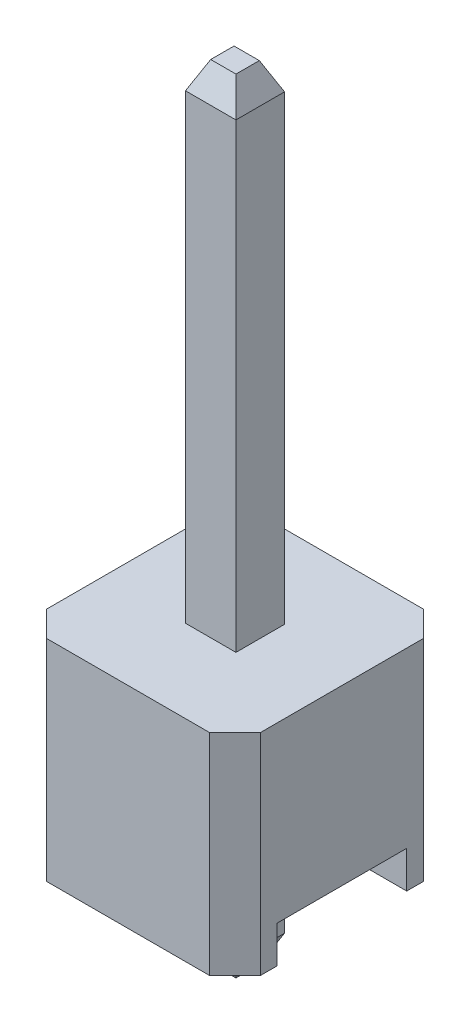
ISO-10303-21;
HEADER;
FILE_DESCRIPTION(('STEP AP214'),'2;1');
FILE_NAME('part.step','',(''),(''),'','','');
FILE_SCHEMA(('AUTOMOTIVE_DESIGN { 1 0 10303 214 1 1 1 1 }'));
ENDSEC;
DATA;
#1=APPLICATION_CONTEXT('core data for automotive mechanical design processes');
#2=APPLICATION_PROTOCOL_DEFINITION('international standard','automotive_design',2000,#1);
#3=PRODUCT_CONTEXT('',#1,'mechanical');
#4=PRODUCT('Part','Part','',(#3));
#5=PRODUCT_RELATED_PRODUCT_CATEGORY('part','',(#4));
#6=PRODUCT_DEFINITION_FORMATION('','',#4);
#7=PRODUCT_DEFINITION_CONTEXT('part definition',#1,'design');
#8=PRODUCT_DEFINITION('design','',#6,#7);
#9=PRODUCT_DEFINITION_SHAPE('','',#8);
#10=(LENGTH_UNIT() NAMED_UNIT(*) SI_UNIT(.MILLI.,.METRE.));
#11=(NAMED_UNIT(*) PLANE_ANGLE_UNIT() SI_UNIT($,.RADIAN.));
#12=(NAMED_UNIT(*) SI_UNIT($,.STERADIAN.) SOLID_ANGLE_UNIT());
#13=UNCERTAINTY_MEASURE_WITH_UNIT(LENGTH_MEASURE(1.E-05),#10,'distance_accuracy_value','');
#14=(GEOMETRIC_REPRESENTATION_CONTEXT(3) GLOBAL_UNCERTAINTY_ASSIGNED_CONTEXT((#13)) GLOBAL_UNIT_ASSIGNED_CONTEXT((#10,
#11,#12)) REPRESENTATION_CONTEXT('',''));
#15=CARTESIAN_POINT('',(0.,0.,0.));
#16=DIRECTION('',(0.,0.,1.));
#17=DIRECTION('',(1.,0.,0.));
#18=AXIS2_PLACEMENT_3D('',#15,#16,#17);
#19=CARTESIAN_POINT('',(13.1274969604626,-5.69124998633488,4.81287404611807));
#20=DIRECTION('',(0.,-1.,0.));
#21=DIRECTION('',(0.,0.,-1.));
#22=AXIS2_PLACEMENT_3D('',#19,#20,#21);
#23=PLANE('',#22);
#24=DIRECTION('',(1.,0.,0.));
#25=VECTOR('',#24,1.);
#26=CARTESIAN_POINT('',(12.5274969604626,-5.69124998633488,4.96287404611807));
#27=LINE('',#26,#25);
#28=CARTESIAN_POINT('',(12.6774969604626,-5.69124998633488,4.96287404611807));
#29=VERTEX_POINT('',#28);
#30=CARTESIAN_POINT('',(12.9774969604626,-5.69124998633488,4.96287404611807));
#31=VERTEX_POINT('',#30);
#32=EDGE_CURVE('E194',#29,#31,#27,.T.);
#33=ORIENTED_EDGE('',*,*,#32,.T.);
#34=DIRECTION('',(0.,0.,1.));
#35=VECTOR('',#34,1.);
#36=CARTESIAN_POINT('',(12.9774969604626,-5.69124998633488,4.81287404611807));
#37=LINE('',#36,#35);
#38=CARTESIAN_POINT('',(12.9774969604626,-5.69124998633488,5.24038017622598));
#39=VERTEX_POINT('',#38);
#40=EDGE_CURVE('E179',#31,#39,#37,.T.);
#41=ORIENTED_EDGE('',*,*,#40,.T.);
#42=DIRECTION('',(1.,0.,0.));
#43=VECTOR('',#42,1.);
#44=CARTESIAN_POINT('',(13.1274969604626,-5.69124998633488,5.24038017622598));
#45=LINE('',#44,#43);
#46=CARTESIAN_POINT('',(12.6774969604626,-5.69124998633488,5.24038017622598));
#47=VERTEX_POINT('',#46);
#48=EDGE_CURVE('E20',#39,#47,#45,.F.);
#49=ORIENTED_EDGE('',*,*,#48,.T.);
#50=DIRECTION('',(0.,0.,1.));
#51=VECTOR('',#50,1.);
#52=CARTESIAN_POINT('',(12.6774969604626,-5.69124998633488,5.39038017622597));
#53=LINE('',#52,#51);
#54=EDGE_CURVE('E174',#47,#29,#53,.F.);
#55=ORIENTED_EDGE('',*,*,#54,.T.);
#56=EDGE_LOOP('',(#33,#41,#49,#55));
#57=FACE_BOUND('',#56,.T.);
#58=ADVANCED_FACE('F17',(#57),#23,.T.);
#59=CARTESIAN_POINT('',(13.1274969604626,-5.36957394825845,5.39038017622597));
#60=DIRECTION('',(0.,0.4226182617407,-0.90630778703665));
#61=DIRECTION('',(0.,0.90630778703665,0.4226182617407));
#62=AXIS2_PLACEMENT_3D('',#59,#60,#61);
#63=PLANE('',#62);
#64=DIRECTION('',(1.,0.,0.));
#65=VECTOR('',#64,1.);
#66=CARTESIAN_POINT('',(13.1274969604626,-5.36957394825845,5.39038017622597));
#67=LINE('',#66,#65);
#68=CARTESIAN_POINT('',(12.5274969604626,-5.36957394825845,5.39038017622597));
#69=VERTEX_POINT('',#68);
#70=CARTESIAN_POINT('',(13.1274969604626,-5.36957394825845,5.39038017622597));
#71=VERTEX_POINT('',#70);
#72=EDGE_CURVE('E186',#69,#71,#67,.T.);
#73=ORIENTED_EDGE('',*,*,#72,.F.);
#74=DIRECTION('',(0.389281620635028,-0.834817129478987,-0.389281620635024));
#75=VECTOR('',#74,1.);
#76=CARTESIAN_POINT('',(12.5274969604626,-5.36957394825845,5.39038017622597));
#77=LINE('',#76,#75);
#78=EDGE_CURVE('E182',#69,#47,#77,.T.);
#79=ORIENTED_EDGE('',*,*,#78,.T.);
#80=ORIENTED_EDGE('',*,*,#48,.F.);
#81=DIRECTION('',(0.389281620635026,0.834817129478987,0.389281620635024));
#82=VECTOR('',#81,1.);
#83=CARTESIAN_POINT('',(12.9774969604626,-5.69124998633488,5.24038017622598));
#84=LINE('',#83,#82);
#85=EDGE_CURVE('E202',#39,#71,#84,.T.);
#86=ORIENTED_EDGE('',*,*,#85,.T.);
#87=EDGE_LOOP('',(#73,#79,#80,#86));
#88=FACE_BOUND('',#87,.T.);
#89=ADVANCED_FACE('F184',(#88),#63,.F.);
#90=CARTESIAN_POINT('',(12.5274969604626,-5.36957394825845,5.39038017622597));
#91=DIRECTION('',(0.906307787036649,0.422618261740701,0.));
#92=DIRECTION('',(-0.422618261740701,0.906307787036649,0.));
#93=AXIS2_PLACEMENT_3D('',#90,#91,#92);
#94=PLANE('',#93);
#95=ORIENTED_EDGE('',*,*,#54,.F.);
#96=ORIENTED_EDGE('',*,*,#78,.F.);
#97=DIRECTION('',(0.,0.,1.));
#98=VECTOR('',#97,1.);
#99=CARTESIAN_POINT('',(12.5274969604626,-5.36957394825845,5.39038017622597));
#100=LINE('',#99,#98);
#101=CARTESIAN_POINT('',(12.5274969604626,-5.36957394825845,4.81287404611806));
#102=VERTEX_POINT('',#101);
#103=EDGE_CURVE('E205',#102,#69,#100,.T.);
#104=ORIENTED_EDGE('',*,*,#103,.F.);
#105=DIRECTION('',(0.389281620635023,-0.834817129478988,0.389281620635028));
#106=VECTOR('',#105,1.);
#107=CARTESIAN_POINT('',(12.5274969604626,-5.36957394825845,4.81287404611806));
#108=LINE('',#107,#106);
#109=EDGE_CURVE('E191',#102,#29,#108,.T.);
#110=ORIENTED_EDGE('',*,*,#109,.T.);
#111=EDGE_LOOP('',(#95,#96,#104,#110));
#112=FACE_BOUND('',#111,.T.);
#113=ADVANCED_FACE('F189',(#112),#94,.F.);
#114=CARTESIAN_POINT('',(12.5274969604626,-5.36957394825845,4.81287404611806));
#115=DIRECTION('',(0.,0.422618261740701,0.906307787036649));
#116=DIRECTION('',(0.,-0.906307787036649,0.422618261740701));
#117=AXIS2_PLACEMENT_3D('',#114,#115,#116);
#118=PLANE('',#117);
#119=ORIENTED_EDGE('',*,*,#32,.F.);
#120=ORIENTED_EDGE('',*,*,#109,.F.);
#121=DIRECTION('',(-1.,0.,0.));
#122=VECTOR('',#121,1.);
#123=CARTESIAN_POINT('',(12.5274969604626,-5.36957394825845,4.81287404611806));
#124=LINE('',#123,#122);
#125=CARTESIAN_POINT('',(13.1274969604626,-5.36957394825845,4.81287404611807));
#126=VERTEX_POINT('',#125);
#127=EDGE_CURVE('E211',#126,#102,#124,.T.);
#128=ORIENTED_EDGE('',*,*,#127,.F.);
#129=DIRECTION('',(-0.389281620635027,-0.834817129478988,0.389281620635022));
#130=VECTOR('',#129,1.);
#131=CARTESIAN_POINT('',(13.1274969604626,-5.36957394825845,4.81287404611807));
#132=LINE('',#131,#130);
#133=EDGE_CURVE('E198',#126,#31,#132,.T.);
#134=ORIENTED_EDGE('',*,*,#133,.T.);
#135=EDGE_LOOP('',(#119,#120,#128,#134));
#136=FACE_BOUND('',#135,.T.);
#137=ADVANCED_FACE('F518',(#136),#118,.F.);
#138=CARTESIAN_POINT('',(13.1274969604626,-5.36957394825845,4.81287404611807));
#139=DIRECTION('',(-0.906307787036649,0.422618261740701,0.));
#140=DIRECTION('',(-0.422618261740701,-0.906307787036649,0.));
#141=AXIS2_PLACEMENT_3D('',#138,#139,#140);
#142=PLANE('',#141);
#143=ORIENTED_EDGE('',*,*,#40,.F.);
#144=ORIENTED_EDGE('',*,*,#133,.F.);
#145=DIRECTION('',(0.,0.,-1.));
#146=VECTOR('',#145,1.);
#147=CARTESIAN_POINT('',(13.1274969604626,-5.36957394825845,4.81287404611807));
#148=LINE('',#147,#146);
#149=EDGE_CURVE('E220',#71,#126,#148,.T.);
#150=ORIENTED_EDGE('',*,*,#149,.F.);
#151=ORIENTED_EDGE('',*,*,#85,.F.);
#152=EDGE_LOOP('',(#143,#144,#150,#151));
#153=FACE_BOUND('',#152,.T.);
#154=ADVANCED_FACE('F514',(#153),#142,.F.);
#155=CARTESIAN_POINT('',(13.1274969604626,-5.69124998633488,5.39038017622597));
#156=DIRECTION('',(0.,0.,1.));
#157=DIRECTION('',(1.,0.,0.));
#158=AXIS2_PLACEMENT_3D('',#155,#156,#157);
#159=PLANE('',#158);
#160=DIRECTION('',(0.,1.,0.));
#161=VECTOR('',#160,1.);
#162=CARTESIAN_POINT('',(13.1274969604626,-5.69124998633488,5.39038017622597));
#163=LINE('',#162,#161);
#164=CARTESIAN_POINT('',(13.1274969604626,-4.25124998633488,5.39038017622597));
#165=VERTEX_POINT('',#164);
#166=EDGE_CURVE('E217',#165,#71,#163,.F.);
#167=ORIENTED_EDGE('',*,*,#166,.F.);
#168=DIRECTION('',(1.,0.,0.));
#169=VECTOR('',#168,1.);
#170=CARTESIAN_POINT('',(11.5574969604626,-4.25124998633488,5.39038017622597));
#171=LINE('',#170,#169);
#172=CARTESIAN_POINT('',(12.5274969604626,-4.25124998633488,5.39038017622597));
#173=VERTEX_POINT('',#172);
#174=EDGE_CURVE('E230',#165,#173,#171,.F.);
#175=ORIENTED_EDGE('',*,*,#174,.T.);
#176=DIRECTION('',(0.,1.,0.));
#177=VECTOR('',#176,1.);
#178=CARTESIAN_POINT('',(12.5274969604626,-5.69124998633488,5.39038017622597));
#179=LINE('',#178,#177);
#180=EDGE_CURVE('E208',#69,#173,#179,.T.);
#181=ORIENTED_EDGE('',*,*,#180,.F.);
#182=ORIENTED_EDGE('',*,*,#72,.T.);
#183=EDGE_LOOP('',(#167,#175,#181,#182));
#184=FACE_BOUND('',#183,.T.);
#185=ADVANCED_FACE('F510',(#184),#159,.T.);
#186=CARTESIAN_POINT('',(12.5274969604626,-5.69124998633488,5.39038017622597));
#187=DIRECTION('',(-1.,0.,0.));
#188=DIRECTION('',(0.,0.,1.));
#189=AXIS2_PLACEMENT_3D('',#186,#187,#188);
#190=PLANE('',#189);
#191=ORIENTED_EDGE('',*,*,#180,.T.);
#192=DIRECTION('',(0.,0.,1.));
#193=VECTOR('',#192,1.);
#194=CARTESIAN_POINT('',(12.5274969604626,-4.25124998633488,5.87162711117202));
#195=LINE('',#194,#193);
#196=CARTESIAN_POINT('',(12.5274969604626,-4.25124998633488,4.81287404611806));
#197=VERTEX_POINT('',#196);
#198=EDGE_CURVE('E232',#173,#197,#195,.F.);
#199=ORIENTED_EDGE('',*,*,#198,.T.);
#200=DIRECTION('',(0.,1.,0.));
#201=VECTOR('',#200,1.);
#202=CARTESIAN_POINT('',(12.5274969604626,-5.69124998633488,4.81287404611806));
#203=LINE('',#202,#201);
#204=EDGE_CURVE('E214',#102,#197,#203,.T.);
#205=ORIENTED_EDGE('',*,*,#204,.F.);
#206=ORIENTED_EDGE('',*,*,#103,.T.);
#207=EDGE_LOOP('',(#191,#199,#205,#206));
#208=FACE_BOUND('',#207,.T.);
#209=ADVANCED_FACE('F506',(#208),#190,.T.);
#210=CARTESIAN_POINT('',(12.5274969604626,-5.69124998633488,4.81287404611806));
#211=DIRECTION('',(0.,0.,-1.));
#212=DIRECTION('',(-1.,0.,0.));
#213=AXIS2_PLACEMENT_3D('',#210,#211,#212);
#214=PLANE('',#213);
#215=ORIENTED_EDGE('',*,*,#204,.T.);
#216=DIRECTION('',(1.,0.,0.));
#217=VECTOR('',#216,1.);
#218=CARTESIAN_POINT('',(11.5574969604626,-4.25124998633488,4.81287404611806));
#219=LINE('',#218,#217);
#220=CARTESIAN_POINT('',(13.1274969604626,-4.25124998633488,4.81287404611807));
#221=VERTEX_POINT('',#220);
#222=EDGE_CURVE('E234',#197,#221,#219,.T.);
#223=ORIENTED_EDGE('',*,*,#222,.T.);
#224=DIRECTION('',(0.,1.,0.));
#225=VECTOR('',#224,1.);
#226=CARTESIAN_POINT('',(13.1274969604626,-5.69124998633488,4.81287404611807));
#227=LINE('',#226,#225);
#228=EDGE_CURVE('E223',#126,#221,#227,.T.);
#229=ORIENTED_EDGE('',*,*,#228,.F.);
#230=ORIENTED_EDGE('',*,*,#127,.T.);
#231=EDGE_LOOP('',(#215,#223,#229,#230));
#232=FACE_BOUND('',#231,.T.);
#233=ADVANCED_FACE('F502',(#232),#214,.T.);
#234=CARTESIAN_POINT('',(13.1274969604626,-5.69124998633488,4.81287404611807));
#235=DIRECTION('',(1.,0.,0.));
#236=DIRECTION('',(0.,0.,-1.));
#237=AXIS2_PLACEMENT_3D('',#234,#235,#236);
#238=PLANE('',#237);
#239=ORIENTED_EDGE('',*,*,#228,.T.);
#240=DIRECTION('',(0.,0.,1.));
#241=VECTOR('',#240,1.);
#242=CARTESIAN_POINT('',(13.1274969604626,-4.25124998633488,5.87162711117202));
#243=LINE('',#242,#241);
#244=EDGE_CURVE('E236',#221,#165,#243,.T.);
#245=ORIENTED_EDGE('',*,*,#244,.T.);
#246=ORIENTED_EDGE('',*,*,#166,.T.);
#247=ORIENTED_EDGE('',*,*,#149,.T.);
#248=EDGE_LOOP('',(#239,#245,#246,#247));
#249=FACE_BOUND('',#248,.T.);
#250=ADVANCED_FACE('F498',(#249),#238,.T.);
#251=CARTESIAN_POINT('',(11.5574969604626,-4.25124998633488,5.87162711117202));
#252=DIRECTION('',(0.,1.,0.));
#253=DIRECTION('',(0.,0.,1.));
#254=AXIS2_PLACEMENT_3D('',#251,#252,#253);
#255=PLANE('',#254);
#256=ORIENTED_EDGE('',*,*,#222,.F.);
#257=ORIENTED_EDGE('',*,*,#198,.F.);
#258=ORIENTED_EDGE('',*,*,#174,.F.);
#259=ORIENTED_EDGE('',*,*,#244,.F.);
#260=EDGE_LOOP('',(#256,#257,#258,#259));
#261=FACE_BOUND('',#260,.T.);
#262=DIRECTION('',(-1.,0.,0.));
#263=VECTOR('',#262,1.);
#264=CARTESIAN_POINT('',(11.5574969604626,-4.25124998633488,4.33162711117202));
#265=LINE('',#264,#263);
#266=CARTESIAN_POINT('',(11.5574969604626,-4.25124998633488,4.33162711117202));
#267=VERTEX_POINT('',#266);
#268=CARTESIAN_POINT('',(14.0974969604626,-4.25124998633488,4.33162711117202));
#269=VERTEX_POINT('',#268);
#270=EDGE_CURVE('E241',#267,#269,#265,.F.);
#271=ORIENTED_EDGE('',*,*,#270,.T.);
#272=DIRECTION('',(0.,0.,1.));
#273=VECTOR('',#272,1.);
#274=CARTESIAN_POINT('',(14.0974969604626,-4.25124998633488,5.87162711117202));
#275=LINE('',#274,#273);
#276=CARTESIAN_POINT('',(14.0974969604626,-4.25124998633488,5.87162711117202));
#277=VERTEX_POINT('',#276);
#278=EDGE_CURVE('E226',#277,#269,#275,.F.);
#279=ORIENTED_EDGE('',*,*,#278,.F.);
#280=DIRECTION('',(1.,0.,0.));
#281=VECTOR('',#280,1.);
#282=CARTESIAN_POINT('',(11.5574969604626,-4.25124998633488,5.87162711117202));
#283=LINE('',#282,#281);
#284=CARTESIAN_POINT('',(11.5574969604626,-4.25124998633488,5.87162711117202));
#285=VERTEX_POINT('',#284);
#286=EDGE_CURVE('E248',#277,#285,#283,.F.);
#287=ORIENTED_EDGE('',*,*,#286,.T.);
#288=DIRECTION('',(0.,0.,1.));
#289=VECTOR('',#288,1.);
#290=CARTESIAN_POINT('',(11.5574969604626,-4.25124998633488,5.87162711117202));
#291=LINE('',#290,#289);
#292=EDGE_CURVE('E228',#267,#285,#291,.T.);
#293=ORIENTED_EDGE('',*,*,#292,.F.);
#294=EDGE_LOOP('',(#271,#279,#287,#293));
#295=FACE_BOUND('',#294,.T.);
#296=ADVANCED_FACE('F495',(#261,#295),#255,.F.);
#297=CARTESIAN_POINT('',(12.9774969604626,3.60875001366512,4.81287404611807));
#298=DIRECTION('',(0.906307787036651,0.422618261740697,0.));
#299=DIRECTION('',(-0.422618261740697,0.906307787036651,0.));
#300=AXIS2_PLACEMENT_3D('',#297,#298,#299);
#301=PLANE('',#300);
#302=DIRECTION('',(0.389281620635029,-0.834817129478987,-0.389281620635022));
#303=VECTOR('',#302,1.);
#304=CARTESIAN_POINT('',(12.9774969604626,3.60875001366512,4.96287404611807));
#305=LINE('',#304,#303);
#306=CARTESIAN_POINT('',(12.9774969604626,3.60875001366512,4.96287404611807));
#307=VERTEX_POINT('',#306);
#308=CARTESIAN_POINT('',(13.1274969604626,3.28707397558869,4.81287404611807));
#309=VERTEX_POINT('',#308);
#310=EDGE_CURVE('E263',#307,#309,#305,.T.);
#311=ORIENTED_EDGE('',*,*,#310,.F.);
#312=DIRECTION('',(0.,0.,-1.));
#313=VECTOR('',#312,1.);
#314=CARTESIAN_POINT('',(12.9774969604626,3.60875001366512,4.81287404611807));
#315=LINE('',#314,#313);
#316=CARTESIAN_POINT('',(12.9774969604626,3.60875001366512,5.24038017622598));
#317=VERTEX_POINT('',#316);
#318=EDGE_CURVE('E256',#307,#317,#315,.F.);
#319=ORIENTED_EDGE('',*,*,#318,.T.);
#320=DIRECTION('',(-0.389281620635028,0.834817129478988,-0.389281620635022));
#321=VECTOR('',#320,1.);
#322=CARTESIAN_POINT('',(13.1274969604626,3.28707397558869,5.39038017622597));
#323=LINE('',#322,#321);
#324=CARTESIAN_POINT('',(13.1274969604626,3.28707397558869,5.39038017622597));
#325=VERTEX_POINT('',#324);
#326=EDGE_CURVE('E253',#325,#317,#323,.T.);
#327=ORIENTED_EDGE('',*,*,#326,.F.);
#328=DIRECTION('',(0.,0.,-1.));
#329=VECTOR('',#328,1.);
#330=CARTESIAN_POINT('',(13.1274969604626,3.28707397558869,4.81287404611807));
#331=LINE('',#330,#329);
#332=EDGE_CURVE('E266',#309,#325,#331,.F.);
#333=ORIENTED_EDGE('',*,*,#332,.F.);
#334=EDGE_LOOP('',(#311,#319,#327,#333));
#335=FACE_BOUND('',#334,.T.);
#336=ADVANCED_FACE('F472',(#335),#301,.T.);
#337=CARTESIAN_POINT('',(11.5574969604626,-4.25124998633488,4.33162711117202));
#338=DIRECTION('',(0.,0.,-1.));
#339=DIRECTION('',(-1.,0.,0.));
#340=AXIS2_PLACEMENT_3D('',#337,#338,#339);
#341=PLANE('',#340);
#342=DIRECTION('',(0.,1.,0.));
#343=VECTOR('',#342,1.);
#344=CARTESIAN_POINT('',(14.0974969604626,-4.25124998633488,4.33162711117202));
#345=LINE('',#344,#343);
#346=CARTESIAN_POINT('',(14.0974969604626,-4.69124998633488,4.33162711117202));
#347=VERTEX_POINT('',#346);
#348=EDGE_CURVE('E244',#269,#347,#345,.F.);
#349=ORIENTED_EDGE('',*,*,#348,.F.);
#350=ORIENTED_EDGE('',*,*,#270,.F.);
#351=DIRECTION('',(0.,1.,0.));
#352=VECTOR('',#351,1.);
#353=CARTESIAN_POINT('',(11.5574969604626,-4.25124998633488,4.33162711117202));
#354=LINE('',#353,#352);
#355=CARTESIAN_POINT('',(11.5574969604626,-4.69124998633488,4.33162711117202));
#356=VERTEX_POINT('',#355);
#357=EDGE_CURVE('E239',#356,#267,#354,.T.);
#358=ORIENTED_EDGE('',*,*,#357,.F.);
#359=DIRECTION('',(1.,0.,0.));
#360=VECTOR('',#359,1.);
#361=CARTESIAN_POINT('',(12.8274969604626,-4.69124998633488,4.33162711117202));
#362=LINE('',#361,#360);
#363=EDGE_CURVE('E273',#356,#347,#362,.T.);
#364=ORIENTED_EDGE('',*,*,#363,.T.);
#365=EDGE_LOOP('',(#349,#350,#358,#364));
#366=FACE_BOUND('',#365,.T.);
#367=ADVANCED_FACE('F488',(#366),#341,.F.);
#368=CARTESIAN_POINT('',(11.5574969604626,-4.25124998633488,5.87162711117202));
#369=DIRECTION('',(0.,0.,1.));
#370=DIRECTION('',(1.,0.,0.));
#371=AXIS2_PLACEMENT_3D('',#368,#369,#370);
#372=PLANE('',#371);
#373=DIRECTION('',(0.,1.,0.));
#374=VECTOR('',#373,1.);
#375=CARTESIAN_POINT('',(11.5574969604626,-4.25124998633488,5.87162711117202));
#376=LINE('',#375,#374);
#377=CARTESIAN_POINT('',(11.5574969604626,-4.69124998633488,5.87162711117202));
#378=VERTEX_POINT('',#377);
#379=EDGE_CURVE('E251',#285,#378,#376,.F.);
#380=ORIENTED_EDGE('',*,*,#379,.F.);
#381=ORIENTED_EDGE('',*,*,#286,.F.);
#382=DIRECTION('',(0.,1.,0.));
#383=VECTOR('',#382,1.);
#384=CARTESIAN_POINT('',(14.0974969604626,-4.25124998633488,5.87162711117202));
#385=LINE('',#384,#383);
#386=CARTESIAN_POINT('',(14.0974969604626,-4.69124998633488,5.87162711117202));
#387=VERTEX_POINT('',#386);
#388=EDGE_CURVE('E246',#387,#277,#385,.T.);
#389=ORIENTED_EDGE('',*,*,#388,.F.);
#390=DIRECTION('',(1.,0.,0.));
#391=VECTOR('',#390,1.);
#392=CARTESIAN_POINT('',(12.8274969604626,-4.69124998633488,5.87162711117202));
#393=LINE('',#392,#391);
#394=EDGE_CURVE('E288',#387,#378,#393,.F.);
#395=ORIENTED_EDGE('',*,*,#394,.T.);
#396=EDGE_LOOP('',(#380,#381,#389,#395));
#397=FACE_BOUND('',#396,.T.);
#398=ADVANCED_FACE('F482',(#397),#372,.F.);
#399=CARTESIAN_POINT('',(13.1274969604626,3.60875001366512,5.24038017622598));
#400=DIRECTION('',(0.,0.422618261740697,0.906307787036651));
#401=DIRECTION('',(0.,-0.906307787036651,0.422618261740697));
#402=AXIS2_PLACEMENT_3D('',#399,#400,#401);
#403=PLANE('',#402);
#404=ORIENTED_EDGE('',*,*,#326,.T.);
#405=DIRECTION('',(1.,0.,0.));
#406=VECTOR('',#405,1.);
#407=CARTESIAN_POINT('',(13.1274969604626,3.60875001366512,5.24038017622598));
#408=LINE('',#407,#406);
#409=CARTESIAN_POINT('',(12.6774969604626,3.60875001366512,5.24038017622598));
#410=VERTEX_POINT('',#409);
#411=EDGE_CURVE('E258',#317,#410,#408,.F.);
#412=ORIENTED_EDGE('',*,*,#411,.T.);
#413=DIRECTION('',(0.389281620635025,0.83481712947899,-0.38928162063502));
#414=VECTOR('',#413,1.);
#415=CARTESIAN_POINT('',(12.5274969604626,3.28707397558869,5.39038017622597));
#416=LINE('',#415,#414);
#417=CARTESIAN_POINT('',(12.5274969604626,3.28707397558869,5.39038017622597));
#418=VERTEX_POINT('',#417);
#419=EDGE_CURVE('E310',#418,#410,#416,.T.);
#420=ORIENTED_EDGE('',*,*,#419,.F.);
#421=DIRECTION('',(1.,0.,0.));
#422=VECTOR('',#421,1.);
#423=CARTESIAN_POINT('',(13.1274969604626,3.28707397558869,5.39038017622597));
#424=LINE('',#423,#422);
#425=EDGE_CURVE('E303',#325,#418,#424,.F.);
#426=ORIENTED_EDGE('',*,*,#425,.F.);
#427=EDGE_LOOP('',(#404,#412,#420,#426));
#428=FACE_BOUND('',#427,.T.);
#429=ADVANCED_FACE('F466',(#428),#403,.T.);
#430=CARTESIAN_POINT('',(13.1274969604626,3.60875001366512,4.81287404611807));
#431=DIRECTION('',(0.,-1.,0.));
#432=DIRECTION('',(0.,0.,-1.));
#433=AXIS2_PLACEMENT_3D('',#430,#431,#432);
#434=PLANE('',#433);
#435=ORIENTED_EDGE('',*,*,#318,.F.);
#436=DIRECTION('',(1.,0.,0.));
#437=VECTOR('',#436,1.);
#438=CARTESIAN_POINT('',(13.1274969604626,3.60875001366512,4.96287404611807));
#439=LINE('',#438,#437);
#440=CARTESIAN_POINT('',(12.6774969604626,3.60875001366512,4.96287404611807));
#441=VERTEX_POINT('',#440);
#442=EDGE_CURVE('E260',#441,#307,#439,.T.);
#443=ORIENTED_EDGE('',*,*,#442,.F.);
#444=DIRECTION('',(0.,0.,1.));
#445=VECTOR('',#444,1.);
#446=CARTESIAN_POINT('',(12.6774969604626,3.60875001366512,4.81287404611807));
#447=LINE('',#446,#445);
#448=EDGE_CURVE('E313',#410,#441,#447,.F.);
#449=ORIENTED_EDGE('',*,*,#448,.F.);
#450=ORIENTED_EDGE('',*,*,#411,.F.);
#451=EDGE_LOOP('',(#435,#443,#449,#450));
#452=FACE_BOUND('',#451,.T.);
#453=ADVANCED_FACE('F474',(#452),#434,.F.);
#454=CARTESIAN_POINT('',(13.1274969604626,3.60875001366512,4.96287404611807));
#455=DIRECTION('',(0.,0.422618261740697,-0.906307787036651));
#456=DIRECTION('',(0.,0.906307787036651,0.422618261740697));
#457=AXIS2_PLACEMENT_3D('',#454,#455,#456);
#458=PLANE('',#457);
#459=ORIENTED_EDGE('',*,*,#310,.T.);
#460=DIRECTION('',(-1.,0.,0.));
#461=VECTOR('',#460,1.);
#462=CARTESIAN_POINT('',(12.5274969604626,3.28707397558869,4.81287404611806));
#463=LINE('',#462,#461);
#464=CARTESIAN_POINT('',(12.5274969604626,3.28707397558869,4.81287404611806));
#465=VERTEX_POINT('',#464);
#466=EDGE_CURVE('E316',#465,#309,#463,.F.);
#467=ORIENTED_EDGE('',*,*,#466,.F.);
#468=DIRECTION('',(-0.389281620635025,-0.834817129478989,-0.389281620635022));
#469=VECTOR('',#468,1.);
#470=CARTESIAN_POINT('',(12.6774969604626,3.60875001366512,4.96287404611807));
#471=LINE('',#470,#469);
#472=EDGE_CURVE('E307',#441,#465,#471,.T.);
#473=ORIENTED_EDGE('',*,*,#472,.F.);
#474=ORIENTED_EDGE('',*,*,#442,.T.);
#475=EDGE_LOOP('',(#459,#467,#473,#474));
#476=FACE_BOUND('',#475,.T.);
#477=ADVANCED_FACE('F471',(#476),#458,.T.);
#478=CARTESIAN_POINT('',(13.1274969604626,-5.69124998633488,4.81287404611807));
#479=DIRECTION('',(1.,0.,0.));
#480=DIRECTION('',(0.,0.,-1.));
#481=AXIS2_PLACEMENT_3D('',#478,#479,#480);
#482=PLANE('',#481);
#483=DIRECTION('',(0.,1.,0.));
#484=VECTOR('',#483,1.);
#485=CARTESIAN_POINT('',(13.1274969604626,-5.69124998633488,5.39038017622597));
#486=LINE('',#485,#484);
#487=CARTESIAN_POINT('',(13.1274969604626,-2.19124998633488,5.39038017622597));
#488=VERTEX_POINT('',#487);
#489=EDGE_CURVE('E300',#488,#325,#486,.T.);
#490=ORIENTED_EDGE('',*,*,#489,.F.);
#491=DIRECTION('',(0.,0.,-1.));
#492=VECTOR('',#491,1.);
#493=CARTESIAN_POINT('',(13.1274969604626,-2.19124998633488,4.81287404611807));
#494=LINE('',#493,#492);
#495=CARTESIAN_POINT('',(13.1274969604626,-2.19124998633488,4.81287404611807));
#496=VERTEX_POINT('',#495);
#497=EDGE_CURVE('E269',#488,#496,#494,.T.);
#498=ORIENTED_EDGE('',*,*,#497,.T.);
#499=DIRECTION('',(0.,1.,0.));
#500=VECTOR('',#499,1.);
#501=CARTESIAN_POINT('',(13.1274969604626,-5.69124998633488,4.81287404611806));
#502=LINE('',#501,#500);
#503=EDGE_CURVE('E319',#309,#496,#502,.F.);
#504=ORIENTED_EDGE('',*,*,#503,.F.);
#505=ORIENTED_EDGE('',*,*,#332,.T.);
#506=EDGE_LOOP('',(#490,#498,#504,#505));
#507=FACE_BOUND('',#506,.T.);
#508=ADVANCED_FACE('F462',(#507),#482,.T.);
#509=CARTESIAN_POINT('',(12.8274969604626,-4.69124998633488,2.86162711117202));
#510=DIRECTION('',(0.,1.,0.));
#511=DIRECTION('',(0.,0.,1.));
#512=AXIS2_PLACEMENT_3D('',#509,#510,#511);
#513=PLANE('',#512);
#514=ORIENTED_EDGE('',*,*,#363,.F.);
#515=DIRECTION('',(0.,0.,1.));
#516=VECTOR('',#515,1.);
#517=CARTESIAN_POINT('',(11.5574969604626,-4.69124998633488,2.86162711117202));
#518=LINE('',#517,#516);
#519=CARTESIAN_POINT('',(11.5574969604626,-4.69124998633488,4.13162711117202));
#520=VERTEX_POINT('',#519);
#521=EDGE_CURVE('E271',#520,#356,#518,.T.);
#522=ORIENTED_EDGE('',*,*,#521,.F.);
#523=DIRECTION('',(0.707106781186547,0.,-0.707106781186548));
#524=VECTOR('',#523,1.);
#525=CARTESIAN_POINT('',(11.8574969604626,-4.69124998633488,3.83162711117202));
#526=LINE('',#525,#524);
#527=CARTESIAN_POINT('',(11.8574969604626,-4.69124998633488,3.83162711117202));
#528=VERTEX_POINT('',#527);
#529=EDGE_CURVE('E280',#520,#528,#526,.T.);
#530=ORIENTED_EDGE('',*,*,#529,.T.);
#531=DIRECTION('',(1.,0.,0.));
#532=VECTOR('',#531,1.);
#533=CARTESIAN_POINT('',(13.7974969604626,-4.69124998633488,3.83162711117202));
#534=LINE('',#533,#532);
#535=CARTESIAN_POINT('',(13.7974969604626,-4.69124998633488,3.83162711117202));
#536=VERTEX_POINT('',#535);
#537=EDGE_CURVE('E330',#528,#536,#534,.T.);
#538=ORIENTED_EDGE('',*,*,#537,.T.);
#539=DIRECTION('',(0.707106781186546,0.,0.707106781186549));
#540=VECTOR('',#539,1.);
#541=CARTESIAN_POINT('',(14.0974969604626,-4.69124998633488,4.13162711117202));
#542=LINE('',#541,#540);
#543=CARTESIAN_POINT('',(14.0974969604626,-4.69124998633488,4.13162711117202));
#544=VERTEX_POINT('',#543);
#545=EDGE_CURVE('E297',#536,#544,#542,.T.);
#546=ORIENTED_EDGE('',*,*,#545,.T.);
#547=DIRECTION('',(0.,0.,1.));
#548=VECTOR('',#547,1.);
#549=CARTESIAN_POINT('',(14.0974969604626,-4.69124998633488,2.86162711117202));
#550=LINE('',#549,#548);
#551=EDGE_CURVE('E276',#347,#544,#550,.F.);
#552=ORIENTED_EDGE('',*,*,#551,.F.);
#553=EDGE_LOOP('',(#514,#522,#530,#538,#546,#552));
#554=FACE_BOUND('',#553,.T.);
#555=ADVANCED_FACE('F630',(#554),#513,.F.);
#556=CARTESIAN_POINT('',(11.8574969604626,-2.19124998633488,3.83162711117202));
#557=DIRECTION('',(0.707106781186548,0.,0.707106781186547));
#558=DIRECTION('',(0.707106781186547,0.,-0.707106781186548));
#559=AXIS2_PLACEMENT_3D('',#556,#557,#558);
#560=PLANE('',#559);
#561=DIRECTION('',(0.,1.,0.));
#562=VECTOR('',#561,1.);
#563=CARTESIAN_POINT('',(11.5574969604626,-2.19124998633488,4.13162711117202));
#564=LINE('',#563,#562);
#565=CARTESIAN_POINT('',(11.5574969604626,-2.19124998633488,4.13162711117202));
#566=VERTEX_POINT('',#565);
#567=EDGE_CURVE('E333',#520,#566,#564,.T.);
#568=ORIENTED_EDGE('',*,*,#567,.T.);
#569=DIRECTION('',(0.707106781186547,0.,-0.707106781186548));
#570=VECTOR('',#569,1.);
#571=CARTESIAN_POINT('',(11.8574969604626,-2.19124998633488,3.83162711117202));
#572=LINE('',#571,#570);
#573=CARTESIAN_POINT('',(11.8574969604626,-2.19124998633488,3.83162711117202));
#574=VERTEX_POINT('',#573);
#575=EDGE_CURVE('E278',#574,#566,#572,.F.);
#576=ORIENTED_EDGE('',*,*,#575,.F.);
#577=DIRECTION('',(0.,1.,0.));
#578=VECTOR('',#577,1.);
#579=CARTESIAN_POINT('',(11.8574969604626,-2.19124998633488,3.83162711117202));
#580=LINE('',#579,#578);
#581=EDGE_CURVE('E327',#574,#528,#580,.F.);
#582=ORIENTED_EDGE('',*,*,#581,.T.);
#583=ORIENTED_EDGE('',*,*,#529,.F.);
#584=EDGE_LOOP('',(#568,#576,#582,#583));
#585=FACE_BOUND('',#584,.T.);
#586=ADVANCED_FACE('F395',(#585),#560,.F.);
#587=CARTESIAN_POINT('',(11.5574969604626,-2.19124998633488,6.07162711117202));
#588=DIRECTION('',(0.707106781186547,0.,-0.707106781186548));
#589=DIRECTION('',(-0.707106781186548,0.,-0.707106781186547));
#590=AXIS2_PLACEMENT_3D('',#587,#588,#589);
#591=PLANE('',#590);
#592=DIRECTION('',(0.,1.,0.));
#593=VECTOR('',#592,1.);
#594=CARTESIAN_POINT('',(11.8574969604626,-2.19124998633488,6.37162711117202));
#595=LINE('',#594,#593);
#596=CARTESIAN_POINT('',(11.8574969604626,-4.69124998633488,6.37162711117202));
#597=VERTEX_POINT('',#596);
#598=CARTESIAN_POINT('',(11.8574969604626,-2.19124998633488,6.37162711117202));
#599=VERTEX_POINT('',#598);
#600=EDGE_CURVE('E341',#597,#599,#595,.T.);
#601=ORIENTED_EDGE('',*,*,#600,.T.);
#602=DIRECTION('',(-0.707106781186548,0.,-0.707106781186547));
#603=VECTOR('',#602,1.);
#604=CARTESIAN_POINT('',(11.5574969604626,-2.19124998633488,6.07162711117202));
#605=LINE('',#604,#603);
#606=CARTESIAN_POINT('',(11.5574969604626,-2.19124998633488,6.07162711117202));
#607=VERTEX_POINT('',#606);
#608=EDGE_CURVE('E282',#607,#599,#605,.F.);
#609=ORIENTED_EDGE('',*,*,#608,.F.);
#610=DIRECTION('',(0.,1.,0.));
#611=VECTOR('',#610,1.);
#612=CARTESIAN_POINT('',(11.5574969604626,-2.19124998633488,6.07162711117202));
#613=LINE('',#612,#611);
#614=CARTESIAN_POINT('',(11.5574969604626,-4.69124998633488,6.07162711117202));
#615=VERTEX_POINT('',#614);
#616=EDGE_CURVE('E336',#607,#615,#613,.F.);
#617=ORIENTED_EDGE('',*,*,#616,.T.);
#618=DIRECTION('',(0.707106781186545,0.,0.70710678118655));
#619=VECTOR('',#618,1.);
#620=CARTESIAN_POINT('',(11.5574969604626,-4.69124998633488,6.07162711117202));
#621=LINE('',#620,#619);
#622=EDGE_CURVE('E284',#615,#597,#621,.T.);
#623=ORIENTED_EDGE('',*,*,#622,.T.);
#624=EDGE_LOOP('',(#601,#609,#617,#623));
#625=FACE_BOUND('',#624,.T.);
#626=ADVANCED_FACE('F402',(#625),#591,.F.);
#627=CARTESIAN_POINT('',(12.8274969604626,-4.69124998633488,2.86162711117202));
#628=DIRECTION('',(0.,1.,0.));
#629=DIRECTION('',(0.,0.,1.));
#630=AXIS2_PLACEMENT_3D('',#627,#628,#629);
#631=PLANE('',#630);
#632=ORIENTED_EDGE('',*,*,#394,.F.);
#633=DIRECTION('',(0.,0.,1.));
#634=VECTOR('',#633,1.);
#635=CARTESIAN_POINT('',(14.0974969604626,-4.69124998633488,2.86162711117202));
#636=LINE('',#635,#634);
#637=CARTESIAN_POINT('',(14.0974969604626,-4.69124998633488,6.07162711117202));
#638=VERTEX_POINT('',#637);
#639=EDGE_CURVE('E286',#638,#387,#636,.F.);
#640=ORIENTED_EDGE('',*,*,#639,.F.);
#641=DIRECTION('',(-0.707106781186549,0.,0.707106781186546));
#642=VECTOR('',#641,1.);
#643=CARTESIAN_POINT('',(13.7974969604626,-4.69124998633488,6.37162711117202));
#644=LINE('',#643,#642);
#645=CARTESIAN_POINT('',(13.7974969604626,-4.69124998633488,6.37162711117202));
#646=VERTEX_POINT('',#645);
#647=EDGE_CURVE('E293',#638,#646,#644,.T.);
#648=ORIENTED_EDGE('',*,*,#647,.T.);
#649=DIRECTION('',(-1.,0.,0.));
#650=VECTOR('',#649,1.);
#651=CARTESIAN_POINT('',(11.8574969604626,-4.69124998633488,6.37162711117202));
#652=LINE('',#651,#650);
#653=EDGE_CURVE('E347',#646,#597,#652,.T.);
#654=ORIENTED_EDGE('',*,*,#653,.T.);
#655=ORIENTED_EDGE('',*,*,#622,.F.);
#656=DIRECTION('',(0.,0.,-1.));
#657=VECTOR('',#656,1.);
#658=CARTESIAN_POINT('',(11.5574969604626,-4.69124998633488,4.13162711117202));
#659=LINE('',#658,#657);
#660=EDGE_CURVE('E338',#615,#378,#659,.T.);
#661=ORIENTED_EDGE('',*,*,#660,.T.);
#662=EDGE_LOOP('',(#632,#640,#648,#654,#655,#661));
#663=FACE_BOUND('',#662,.T.);
#664=ADVANCED_FACE('F405',(#663),#631,.F.);
#665=CARTESIAN_POINT('',(13.7974969604626,-2.19124998633488,6.37162711117202));
#666=DIRECTION('',(-0.707106781186546,0.,-0.707106781186549));
#667=DIRECTION('',(-0.707106781186549,0.,0.707106781186546));
#668=AXIS2_PLACEMENT_3D('',#665,#666,#667);
#669=PLANE('',#668);
#670=DIRECTION('',(0.,1.,0.));
#671=VECTOR('',#670,1.);
#672=CARTESIAN_POINT('',(14.0974969604626,-2.19124998633488,6.07162711117202));
#673=LINE('',#672,#671);
#674=CARTESIAN_POINT('',(14.0974969604626,-2.19124998633488,6.07162711117202));
#675=VERTEX_POINT('',#674);
#676=EDGE_CURVE('E350',#638,#675,#673,.T.);
#677=ORIENTED_EDGE('',*,*,#676,.T.);
#678=DIRECTION('',(-0.707106781186549,0.,0.707106781186546));
#679=VECTOR('',#678,1.);
#680=CARTESIAN_POINT('',(13.7974969604626,-2.19124998633488,6.37162711117202));
#681=LINE('',#680,#679);
#682=CARTESIAN_POINT('',(13.7974969604626,-2.19124998633488,6.37162711117202));
#683=VERTEX_POINT('',#682);
#684=EDGE_CURVE('E291',#683,#675,#681,.F.);
#685=ORIENTED_EDGE('',*,*,#684,.F.);
#686=DIRECTION('',(0.,1.,0.));
#687=VECTOR('',#686,1.);
#688=CARTESIAN_POINT('',(13.7974969604626,-2.19124998633488,6.37162711117202));
#689=LINE('',#688,#687);
#690=EDGE_CURVE('E344',#683,#646,#689,.F.);
#691=ORIENTED_EDGE('',*,*,#690,.T.);
#692=ORIENTED_EDGE('',*,*,#647,.F.);
#693=EDGE_LOOP('',(#677,#685,#691,#692));
#694=FACE_BOUND('',#693,.T.);
#695=ADVANCED_FACE('F414',(#694),#669,.F.);
#696=CARTESIAN_POINT('',(14.0974969604626,-2.19124998633488,4.13162711117202));
#697=DIRECTION('',(-0.707106781186549,0.,0.707106781186546));
#698=DIRECTION('',(0.707106781186546,0.,0.707106781186549));
#699=AXIS2_PLACEMENT_3D('',#696,#697,#698);
#700=PLANE('',#699);
#701=DIRECTION('',(0.,1.,0.));
#702=VECTOR('',#701,1.);
#703=CARTESIAN_POINT('',(13.7974969604626,-2.19124998633488,3.83162711117202));
#704=LINE('',#703,#702);
#705=CARTESIAN_POINT('',(13.7974969604626,-2.19124998633488,3.83162711117202));
#706=VERTEX_POINT('',#705);
#707=EDGE_CURVE('E324',#536,#706,#704,.T.);
#708=ORIENTED_EDGE('',*,*,#707,.T.);
#709=DIRECTION('',(0.707106781186546,0.,0.707106781186549));
#710=VECTOR('',#709,1.);
#711=CARTESIAN_POINT('',(14.0974969604626,-2.19124998633488,4.13162711117202));
#712=LINE('',#711,#710);
#713=CARTESIAN_POINT('',(14.0974969604626,-2.19124998633488,4.13162711117202));
#714=VERTEX_POINT('',#713);
#715=EDGE_CURVE('E295',#714,#706,#712,.F.);
#716=ORIENTED_EDGE('',*,*,#715,.F.);
#717=DIRECTION('',(0.,1.,0.));
#718=VECTOR('',#717,1.);
#719=CARTESIAN_POINT('',(14.0974969604626,-2.19124998633488,4.13162711117202));
#720=LINE('',#719,#718);
#721=EDGE_CURVE('E353',#714,#544,#720,.F.);
#722=ORIENTED_EDGE('',*,*,#721,.T.);
#723=ORIENTED_EDGE('',*,*,#545,.F.);
#724=EDGE_LOOP('',(#708,#716,#722,#723));
#725=FACE_BOUND('',#724,.T.);
#726=ADVANCED_FACE('F384',(#725),#700,.F.);
#727=CARTESIAN_POINT('',(13.1274969604626,-5.69124998633488,5.39038017622597));
#728=DIRECTION('',(0.,0.,1.));
#729=DIRECTION('',(1.,0.,0.));
#730=AXIS2_PLACEMENT_3D('',#727,#728,#729);
#731=PLANE('',#730);
#732=DIRECTION('',(0.,1.,0.));
#733=VECTOR('',#732,1.);
#734=CARTESIAN_POINT('',(12.5274969604626,-5.69124998633488,5.39038017622597));
#735=LINE('',#734,#733);
#736=CARTESIAN_POINT('',(12.5274969604626,-2.19124998633488,5.39038017622597));
#737=VERTEX_POINT('',#736);
#738=EDGE_CURVE('E356',#737,#418,#735,.T.);
#739=ORIENTED_EDGE('',*,*,#738,.F.);
#740=DIRECTION('',(1.,0.,0.));
#741=VECTOR('',#740,1.);
#742=CARTESIAN_POINT('',(13.1274969604626,-2.19124998633488,5.39038017622597));
#743=LINE('',#742,#741);
#744=EDGE_CURVE('E34',#737,#488,#743,.T.);
#745=ORIENTED_EDGE('',*,*,#744,.T.);
#746=ORIENTED_EDGE('',*,*,#489,.T.);
#747=ORIENTED_EDGE('',*,*,#425,.T.);
#748=EDGE_LOOP('',(#739,#745,#746,#747));
#749=FACE_BOUND('',#748,.T.);
#750=ADVANCED_FACE('F422',(#749),#731,.T.);
#751=CARTESIAN_POINT('',(12.6774969604626,3.60875001366512,4.81287404611807));
#752=DIRECTION('',(-0.906307787036651,0.422618261740697,0.));
#753=DIRECTION('',(-0.422618261740697,-0.906307787036651,0.));
#754=AXIS2_PLACEMENT_3D('',#751,#752,#753);
#755=PLANE('',#754);
#756=ORIENTED_EDGE('',*,*,#419,.T.);
#757=ORIENTED_EDGE('',*,*,#448,.T.);
#758=ORIENTED_EDGE('',*,*,#472,.T.);
#759=DIRECTION('',(0.,0.,1.));
#760=VECTOR('',#759,1.);
#761=CARTESIAN_POINT('',(12.5274969604626,3.28707397558869,5.39038017622597));
#762=LINE('',#761,#760);
#763=EDGE_CURVE('E359',#418,#465,#762,.F.);
#764=ORIENTED_EDGE('',*,*,#763,.F.);
#765=EDGE_LOOP('',(#756,#757,#758,#764));
#766=FACE_BOUND('',#765,.T.);
#767=ADVANCED_FACE('F445',(#766),#755,.T.);
#768=CARTESIAN_POINT('',(12.5274969604626,-5.69124998633488,4.81287404611806));
#769=DIRECTION('',(0.,0.,-1.));
#770=DIRECTION('',(-1.,0.,0.));
#771=AXIS2_PLACEMENT_3D('',#768,#769,#770);
#772=PLANE('',#771);
#773=ORIENTED_EDGE('',*,*,#503,.T.);
#774=DIRECTION('',(-1.,0.,0.));
#775=VECTOR('',#774,1.);
#776=CARTESIAN_POINT('',(12.5274969604626,-2.19124998633488,4.81287404611806));
#777=LINE('',#776,#775);
#778=CARTESIAN_POINT('',(12.5274969604626,-2.19124998633488,4.81287404611806));
#779=VERTEX_POINT('',#778);
#780=EDGE_CURVE('E322',#496,#779,#777,.T.);
#781=ORIENTED_EDGE('',*,*,#780,.T.);
#782=DIRECTION('',(0.,1.,0.));
#783=VECTOR('',#782,1.);
#784=CARTESIAN_POINT('',(12.5274969604626,-5.69124998633488,4.81287404611806));
#785=LINE('',#784,#783);
#786=EDGE_CURVE('E362',#465,#779,#785,.F.);
#787=ORIENTED_EDGE('',*,*,#786,.F.);
#788=ORIENTED_EDGE('',*,*,#466,.T.);
#789=EDGE_LOOP('',(#773,#781,#787,#788));
#790=FACE_BOUND('',#789,.T.);
#791=ADVANCED_FACE('F442',(#790),#772,.T.);
#792=CARTESIAN_POINT('',(13.7974969604626,-2.19124998633488,3.83162711117202));
#793=DIRECTION('',(0.,0.,1.));
#794=DIRECTION('',(1.,0.,0.));
#795=AXIS2_PLACEMENT_3D('',#792,#793,#794);
#796=PLANE('',#795);
#797=ORIENTED_EDGE('',*,*,#581,.F.);
#798=DIRECTION('',(1.,0.,0.));
#799=VECTOR('',#798,1.);
#800=CARTESIAN_POINT('',(12.8274969604626,-2.19124998633488,3.83162711117202));
#801=LINE('',#800,#799);
#802=EDGE_CURVE('E365',#706,#574,#801,.F.);
#803=ORIENTED_EDGE('',*,*,#802,.F.);
#804=ORIENTED_EDGE('',*,*,#707,.F.);
#805=ORIENTED_EDGE('',*,*,#537,.F.);
#806=EDGE_LOOP('',(#797,#803,#804,#805));
#807=FACE_BOUND('',#806,.T.);
#808=ADVANCED_FACE('F390',(#807),#796,.F.);
#809=CARTESIAN_POINT('',(11.5574969604626,-2.19124998633488,4.13162711117202));
#810=DIRECTION('',(1.,0.,0.));
#811=DIRECTION('',(0.,0.,-1.));
#812=AXIS2_PLACEMENT_3D('',#809,#810,#811);
#813=PLANE('',#812);
#814=ORIENTED_EDGE('',*,*,#379,.T.);
#815=ORIENTED_EDGE('',*,*,#660,.F.);
#816=ORIENTED_EDGE('',*,*,#616,.F.);
#817=DIRECTION('',(0.,0.,1.));
#818=VECTOR('',#817,1.);
#819=CARTESIAN_POINT('',(11.5574969604626,-2.19124998633488,2.86162711117202));
#820=LINE('',#819,#818);
#821=EDGE_CURVE('E368',#566,#607,#820,.T.);
#822=ORIENTED_EDGE('',*,*,#821,.F.);
#823=ORIENTED_EDGE('',*,*,#567,.F.);
#824=ORIENTED_EDGE('',*,*,#521,.T.);
#825=ORIENTED_EDGE('',*,*,#357,.T.);
#826=ORIENTED_EDGE('',*,*,#292,.T.);
#827=EDGE_LOOP('',(#814,#815,#816,#822,#823,#824,#825,#826));
#828=FACE_BOUND('',#827,.T.);
#829=ADVANCED_FACE('F398',(#828),#813,.F.);
#830=CARTESIAN_POINT('',(11.8574969604626,-2.19124998633488,6.37162711117202));
#831=DIRECTION('',(0.,0.,-1.));
#832=DIRECTION('',(-1.,0.,0.));
#833=AXIS2_PLACEMENT_3D('',#830,#831,#832);
#834=PLANE('',#833);
#835=ORIENTED_EDGE('',*,*,#690,.F.);
#836=DIRECTION('',(1.,0.,0.));
#837=VECTOR('',#836,1.);
#838=CARTESIAN_POINT('',(12.8274969604626,-2.19124998633488,6.37162711117202));
#839=LINE('',#838,#837);
#840=EDGE_CURVE('E371',#599,#683,#839,.T.);
#841=ORIENTED_EDGE('',*,*,#840,.F.);
#842=ORIENTED_EDGE('',*,*,#600,.F.);
#843=ORIENTED_EDGE('',*,*,#653,.F.);
#844=EDGE_LOOP('',(#835,#841,#842,#843));
#845=FACE_BOUND('',#844,.T.);
#846=ADVANCED_FACE('F412',(#845),#834,.F.);
#847=CARTESIAN_POINT('',(14.0974969604626,-2.19124998633488,6.07162711117202));
#848=DIRECTION('',(-1.,0.,0.));
#849=DIRECTION('',(0.,0.,1.));
#850=AXIS2_PLACEMENT_3D('',#847,#848,#849);
#851=PLANE('',#850);
#852=ORIENTED_EDGE('',*,*,#388,.T.);
#853=ORIENTED_EDGE('',*,*,#278,.T.);
#854=ORIENTED_EDGE('',*,*,#348,.T.);
#855=ORIENTED_EDGE('',*,*,#551,.T.);
#856=ORIENTED_EDGE('',*,*,#721,.F.);
#857=DIRECTION('',(0.,0.,1.));
#858=VECTOR('',#857,1.);
#859=CARTESIAN_POINT('',(14.0974969604626,-2.19124998633488,2.86162711117202));
#860=LINE('',#859,#858);
#861=EDGE_CURVE('E26',#675,#714,#860,.F.);
#862=ORIENTED_EDGE('',*,*,#861,.F.);
#863=ORIENTED_EDGE('',*,*,#676,.F.);
#864=ORIENTED_EDGE('',*,*,#639,.T.);
#865=EDGE_LOOP('',(#852,#853,#854,#855,#856,#862,#863,#864));
#866=FACE_BOUND('',#865,.T.);
#867=ADVANCED_FACE('F381',(#866),#851,.F.);
#868=CARTESIAN_POINT('',(12.5274969604626,-5.69124998633488,5.39038017622597));
#869=DIRECTION('',(-1.,0.,0.));
#870=DIRECTION('',(0.,0.,1.));
#871=AXIS2_PLACEMENT_3D('',#868,#869,#870);
#872=PLANE('',#871);
#873=ORIENTED_EDGE('',*,*,#786,.T.);
#874=DIRECTION('',(0.,0.,1.));
#875=VECTOR('',#874,1.);
#876=CARTESIAN_POINT('',(12.5274969604626,-2.19124998633488,2.86162711117202));
#877=LINE('',#876,#875);
#878=EDGE_CURVE('E11',#737,#779,#877,.F.);
#879=ORIENTED_EDGE('',*,*,#878,.F.);
#880=ORIENTED_EDGE('',*,*,#738,.T.);
#881=ORIENTED_EDGE('',*,*,#763,.T.);
#882=EDGE_LOOP('',(#873,#879,#880,#881));
#883=FACE_BOUND('',#882,.T.);
#884=ADVANCED_FACE('F426',(#883),#872,.T.);
#885=CARTESIAN_POINT('',(12.8274969604626,-2.19124998633488,2.86162711117202));
#886=DIRECTION('',(0.,1.,0.));
#887=DIRECTION('',(0.,0.,1.));
#888=AXIS2_PLACEMENT_3D('',#885,#886,#887);
#889=PLANE('',#888);
#890=ORIENTED_EDGE('',*,*,#744,.F.);
#891=ORIENTED_EDGE('',*,*,#878,.T.);
#892=ORIENTED_EDGE('',*,*,#780,.F.);
#893=ORIENTED_EDGE('',*,*,#497,.F.);
#894=EDGE_LOOP('',(#890,#891,#892,#893));
#895=FACE_BOUND('',#894,.T.);
#896=ORIENTED_EDGE('',*,*,#684,.T.);
#897=ORIENTED_EDGE('',*,*,#861,.T.);
#898=ORIENTED_EDGE('',*,*,#715,.T.);
#899=ORIENTED_EDGE('',*,*,#802,.T.);
#900=ORIENTED_EDGE('',*,*,#575,.T.);
#901=ORIENTED_EDGE('',*,*,#821,.T.);
#902=ORIENTED_EDGE('',*,*,#608,.T.);
#903=ORIENTED_EDGE('',*,*,#840,.T.);
#904=EDGE_LOOP('',(#896,#897,#898,#899,#900,#901,#902,#903));
#905=FACE_BOUND('',#904,.T.);
#906=ADVANCED_FACE('F377',(#895,#905),#889,.T.);
#907=CLOSED_SHELL('',(#58,#89,#113,#137,#154,#185,#209,#233,#250,#296,#336,#367,#398,#429,#453,
#477,#508,#555,#586,#626,#664,#695,#726,#750,#767,#791,#808,#829,#846,#867,#884,#906));
#908=MANIFOLD_SOLID_BREP('B1',#907);
#909=ADVANCED_BREP_SHAPE_REPRESENTATION('',(#18,#908),#14);
#910=SHAPE_DEFINITION_REPRESENTATION(#9,#909);
ENDSEC;
END-ISO-10303-21;
